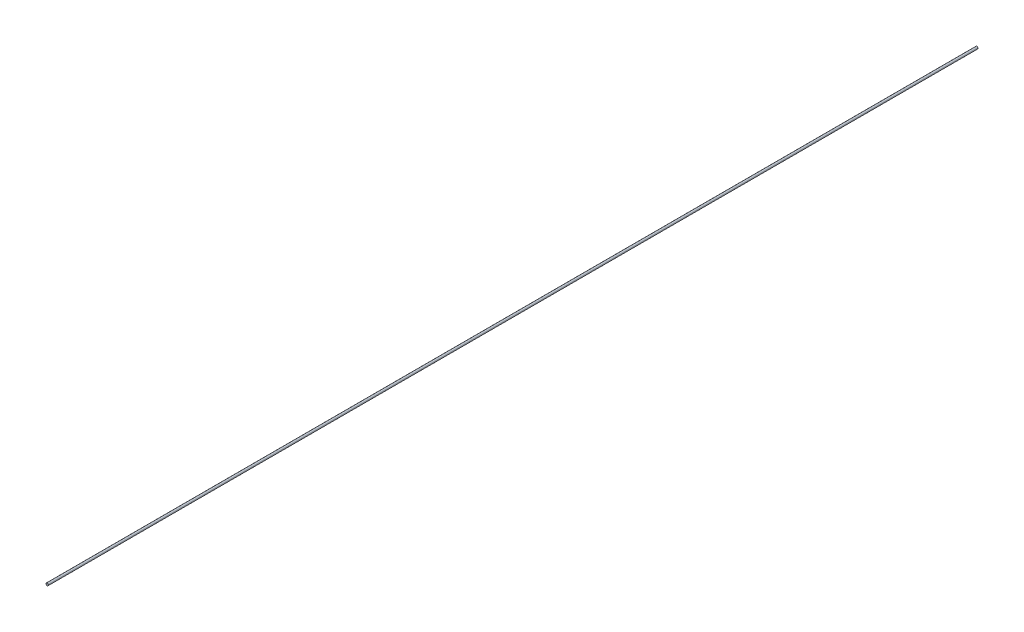
ISO-10303-21;
HEADER;
FILE_DESCRIPTION(('STEP AP214'),'2;1');
FILE_NAME('part.step','',(''),(''),'','','');
FILE_SCHEMA(('AUTOMOTIVE_DESIGN { 1 0 10303 214 1 1 1 1 }'));
ENDSEC;
DATA;
#1=APPLICATION_CONTEXT('core data for automotive mechanical design processes');
#2=APPLICATION_PROTOCOL_DEFINITION('international standard','automotive_design',2000,#1);
#3=PRODUCT_CONTEXT('',#1,'mechanical');
#4=PRODUCT('Part','Part','',(#3));
#5=PRODUCT_RELATED_PRODUCT_CATEGORY('part','',(#4));
#6=PRODUCT_DEFINITION_FORMATION('','',#4);
#7=PRODUCT_DEFINITION_CONTEXT('part definition',#1,'design');
#8=PRODUCT_DEFINITION('design','',#6,#7);
#9=PRODUCT_DEFINITION_SHAPE('','',#8);
#10=(LENGTH_UNIT() NAMED_UNIT(*) SI_UNIT(.MILLI.,.METRE.));
#11=(NAMED_UNIT(*) PLANE_ANGLE_UNIT() SI_UNIT($,.RADIAN.));
#12=(NAMED_UNIT(*) SI_UNIT($,.STERADIAN.) SOLID_ANGLE_UNIT());
#13=UNCERTAINTY_MEASURE_WITH_UNIT(LENGTH_MEASURE(1.E-05),#10,'distance_accuracy_value','');
#14=(GEOMETRIC_REPRESENTATION_CONTEXT(3) GLOBAL_UNCERTAINTY_ASSIGNED_CONTEXT((#13)) GLOBAL_UNIT_ASSIGNED_CONTEXT((#10,
#11,#12)) REPRESENTATION_CONTEXT('',''));
#15=CARTESIAN_POINT('',(0.,0.,0.));
#16=DIRECTION('',(0.,0.,1.));
#17=DIRECTION('',(1.,0.,0.));
#18=AXIS2_PLACEMENT_3D('',#15,#16,#17);
#19=CARTESIAN_POINT('',(0.,0.,101.7));
#20=DIRECTION('',(0.,0.,-1.));
#21=DIRECTION('',(-1.,0.,0.));
#22=AXIS2_PLACEMENT_3D('',#19,#20,#21);
#23=CYLINDRICAL_SURFACE('',#22,0.25);
#24=CARTESIAN_POINT('',(0.,0.,101.7));
#25=DIRECTION('',(0.,0.,1.));
#26=DIRECTION('',(1.,0.,0.));
#27=AXIS2_PLACEMENT_3D('',#24,#25,#26);
#28=CIRCLE('',#27,0.25);
#29=CARTESIAN_POINT('',(0.25,0.,101.7));
#30=VERTEX_POINT('',#29);
#31=EDGE_CURVE('E10',#30,#30,#28,.T.);
#32=ORIENTED_EDGE('',*,*,#31,.F.);
#33=EDGE_LOOP('',(#32));
#34=FACE_BOUND('',#33,.T.);
#35=CARTESIAN_POINT('',(0.,0.,-101.7));
#36=DIRECTION('',(0.,0.,1.));
#37=DIRECTION('',(1.,0.,0.));
#38=AXIS2_PLACEMENT_3D('',#35,#36,#37);
#39=CIRCLE('',#38,0.25);
#40=CARTESIAN_POINT('',(0.25,0.,-101.7));
#41=VERTEX_POINT('',#40);
#42=EDGE_CURVE('E33',#41,#41,#39,.T.);
#43=ORIENTED_EDGE('',*,*,#42,.T.);
#44=EDGE_LOOP('',(#43));
#45=FACE_BOUND('',#44,.T.);
#46=ADVANCED_FACE('F30',(#34,#45),#23,.T.);
#47=CARTESIAN_POINT('',(0.,0.,101.7));
#48=DIRECTION('',(0.,0.,1.));
#49=DIRECTION('',(1.,0.,0.));
#50=AXIS2_PLACEMENT_3D('',#47,#48,#49);
#51=PLANE('',#50);
#52=ORIENTED_EDGE('',*,*,#31,.T.);
#53=EDGE_LOOP('',(#52));
#54=FACE_BOUND('',#53,.T.);
#55=ADVANCED_FACE('F45',(#54),#51,.T.);
#56=CARTESIAN_POINT('',(0.,0.,-101.7));
#57=DIRECTION('',(0.,0.,1.));
#58=DIRECTION('',(1.,0.,0.));
#59=AXIS2_PLACEMENT_3D('',#56,#57,#58);
#60=PLANE('',#59);
#61=ORIENTED_EDGE('',*,*,#42,.F.);
#62=EDGE_LOOP('',(#61));
#63=FACE_BOUND('',#62,.T.);
#64=ADVANCED_FACE('F43',(#63),#60,.F.);
#65=CLOSED_SHELL('',(#46,#55,#64));
#66=MANIFOLD_SOLID_BREP('B2',#65);
#67=ADVANCED_BREP_SHAPE_REPRESENTATION('',(#18,#66),#14);
#68=SHAPE_DEFINITION_REPRESENTATION(#9,#67);
ENDSEC;
END-ISO-10303-21;
